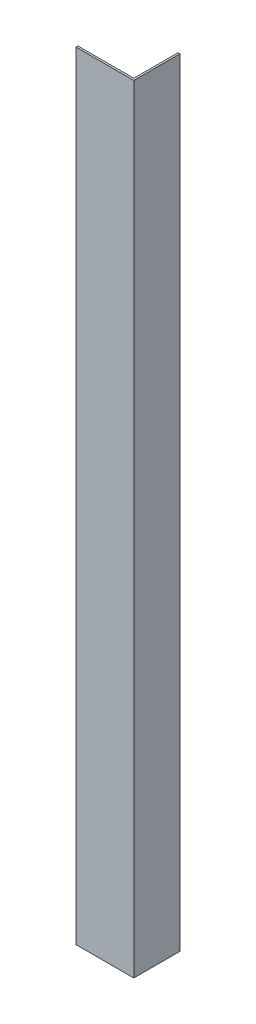
ISO-10303-21;
HEADER;
FILE_DESCRIPTION(('STEP AP214'),'2;1');
FILE_NAME('part.step','',(''),(''),'','','');
FILE_SCHEMA(('AUTOMOTIVE_DESIGN { 1 0 10303 214 1 1 1 1 }'));
ENDSEC;
DATA;
#1=APPLICATION_CONTEXT('core data for automotive mechanical design processes');
#2=APPLICATION_PROTOCOL_DEFINITION('international standard','automotive_design',2000,#1);
#3=PRODUCT_CONTEXT('',#1,'mechanical');
#4=PRODUCT('Part','Part','',(#3));
#5=PRODUCT_RELATED_PRODUCT_CATEGORY('part','',(#4));
#6=PRODUCT_DEFINITION_FORMATION('','',#4);
#7=PRODUCT_DEFINITION_CONTEXT('part definition',#1,'design');
#8=PRODUCT_DEFINITION('design','',#6,#7);
#9=PRODUCT_DEFINITION_SHAPE('','',#8);
#10=(LENGTH_UNIT() NAMED_UNIT(*) SI_UNIT(.MILLI.,.METRE.));
#11=(NAMED_UNIT(*) PLANE_ANGLE_UNIT() SI_UNIT($,.RADIAN.));
#12=(NAMED_UNIT(*) SI_UNIT($,.STERADIAN.) SOLID_ANGLE_UNIT());
#13=UNCERTAINTY_MEASURE_WITH_UNIT(LENGTH_MEASURE(1.E-05),#10,'distance_accuracy_value','');
#14=(GEOMETRIC_REPRESENTATION_CONTEXT(3) GLOBAL_UNCERTAINTY_ASSIGNED_CONTEXT((#13)) GLOBAL_UNIT_ASSIGNED_CONTEXT((#10,
#11,#12)) REPRESENTATION_CONTEXT('',''));
#15=CARTESIAN_POINT('',(0.,0.,0.));
#16=DIRECTION('',(0.,0.,1.));
#17=DIRECTION('',(1.,0.,0.));
#18=AXIS2_PLACEMENT_3D('',#15,#16,#17);
#19=CARTESIAN_POINT('',(0.,202.,-0.5));
#20=DIRECTION('',(1.,0.,0.));
#21=DIRECTION('',(0.,0.,-1.));
#22=AXIS2_PLACEMENT_3D('',#19,#20,#21);
#23=PLANE('',#22);
#24=DIRECTION('',(0.,0.,1.));
#25=VECTOR('',#24,1.);
#26=CARTESIAN_POINT('',(0.,0.,-0.5));
#27=LINE('',#26,#25);
#28=CARTESIAN_POINT('',(0.,0.,-0.5));
#29=VERTEX_POINT('',#28);
#30=CARTESIAN_POINT('',(0.,0.,0.));
#31=VERTEX_POINT('',#30);
#32=EDGE_CURVE('E125',#29,#31,#27,.T.);
#33=ORIENTED_EDGE('',*,*,#32,.T.);
#34=DIRECTION('',(0.,-1.,0.));
#35=VECTOR('',#34,1.);
#36=CARTESIAN_POINT('',(0.,202.,0.));
#37=LINE('',#36,#35);
#38=CARTESIAN_POINT('',(0.,202.,0.));
#39=VERTEX_POINT('',#38);
#40=EDGE_CURVE('E11',#39,#31,#37,.T.);
#41=ORIENTED_EDGE('',*,*,#40,.F.);
#42=DIRECTION('',(0.,0.,1.));
#43=VECTOR('',#42,1.);
#44=CARTESIAN_POINT('',(0.,202.,-0.5));
#45=LINE('',#44,#43);
#46=CARTESIAN_POINT('',(0.,202.,-0.5));
#47=VERTEX_POINT('',#46);
#48=EDGE_CURVE('E135',#47,#39,#45,.T.);
#49=ORIENTED_EDGE('',*,*,#48,.F.);
#50=DIRECTION('',(0.,-1.,0.));
#51=VECTOR('',#50,1.);
#52=CARTESIAN_POINT('',(0.,202.,-0.5));
#53=LINE('',#52,#51);
#54=EDGE_CURVE('E121',#47,#29,#53,.T.);
#55=ORIENTED_EDGE('',*,*,#54,.T.);
#56=EDGE_LOOP('',(#33,#41,#49,#55));
#57=FACE_BOUND('',#56,.T.);
#58=ADVANCED_FACE('F41',(#57),#23,.F.);
#59=CARTESIAN_POINT('',(0.,202.,0.));
#60=DIRECTION('',(0.,0.,-1.));
#61=DIRECTION('',(-1.,0.,0.));
#62=AXIS2_PLACEMENT_3D('',#59,#60,#61);
#63=PLANE('',#62);
#64=DIRECTION('',(1.,0.,0.));
#65=VECTOR('',#64,1.);
#66=CARTESIAN_POINT('',(0.,0.,0.));
#67=LINE('',#66,#65);
#68=CARTESIAN_POINT('',(15.,0.,0.));
#69=VERTEX_POINT('',#68);
#70=EDGE_CURVE('E128',#31,#69,#67,.T.);
#71=ORIENTED_EDGE('',*,*,#70,.T.);
#72=DIRECTION('',(0.,-1.,0.));
#73=VECTOR('',#72,1.);
#74=CARTESIAN_POINT('',(15.,202.,0.));
#75=LINE('',#74,#73);
#76=CARTESIAN_POINT('',(15.,202.,0.));
#77=VERTEX_POINT('',#76);
#78=EDGE_CURVE('E49',#77,#69,#75,.T.);
#79=ORIENTED_EDGE('',*,*,#78,.F.);
#80=DIRECTION('',(1.,0.,0.));
#81=VECTOR('',#80,1.);
#82=CARTESIAN_POINT('',(0.,202.,0.));
#83=LINE('',#82,#81);
#84=EDGE_CURVE('E94',#39,#77,#83,.T.);
#85=ORIENTED_EDGE('',*,*,#84,.F.);
#86=ORIENTED_EDGE('',*,*,#40,.T.);
#87=EDGE_LOOP('',(#71,#79,#85,#86));
#88=FACE_BOUND('',#87,.T.);
#89=ADVANCED_FACE('F159',(#88),#63,.F.);
#90=CARTESIAN_POINT('',(15.,202.,0.));
#91=DIRECTION('',(-1.,0.,0.));
#92=DIRECTION('',(0.,0.,1.));
#93=AXIS2_PLACEMENT_3D('',#90,#91,#92);
#94=PLANE('',#93);
#95=DIRECTION('',(0.,0.,-1.));
#96=VECTOR('',#95,1.);
#97=CARTESIAN_POINT('',(15.,0.,0.));
#98=LINE('',#97,#96);
#99=CARTESIAN_POINT('',(15.,0.,-12.));
#100=VERTEX_POINT('',#99);
#101=EDGE_CURVE('E130',#69,#100,#98,.T.);
#102=ORIENTED_EDGE('',*,*,#101,.T.);
#103=DIRECTION('',(0.,-1.,0.));
#104=VECTOR('',#103,1.);
#105=CARTESIAN_POINT('',(15.,202.,-12.));
#106=LINE('',#105,#104);
#107=CARTESIAN_POINT('',(15.,202.,-12.));
#108=VERTEX_POINT('',#107);
#109=EDGE_CURVE('E116',#108,#100,#106,.T.);
#110=ORIENTED_EDGE('',*,*,#109,.F.);
#111=DIRECTION('',(0.,0.,-1.));
#112=VECTOR('',#111,1.);
#113=CARTESIAN_POINT('',(15.,202.,0.));
#114=LINE('',#113,#112);
#115=EDGE_CURVE('E107',#77,#108,#114,.T.);
#116=ORIENTED_EDGE('',*,*,#115,.F.);
#117=ORIENTED_EDGE('',*,*,#78,.T.);
#118=EDGE_LOOP('',(#102,#110,#116,#117));
#119=FACE_BOUND('',#118,.T.);
#120=ADVANCED_FACE('F141',(#119),#94,.F.);
#121=CARTESIAN_POINT('',(15.,202.,-12.));
#122=DIRECTION('',(0.,0.,1.));
#123=DIRECTION('',(1.,0.,0.));
#124=AXIS2_PLACEMENT_3D('',#121,#122,#123);
#125=PLANE('',#124);
#126=DIRECTION('',(-1.,0.,0.));
#127=VECTOR('',#126,1.);
#128=CARTESIAN_POINT('',(15.,0.,-12.));
#129=LINE('',#128,#127);
#130=CARTESIAN_POINT('',(14.5,0.,-12.));
#131=VERTEX_POINT('',#130);
#132=EDGE_CURVE('E115',#100,#131,#129,.T.);
#133=ORIENTED_EDGE('',*,*,#132,.T.);
#134=DIRECTION('',(0.,-1.,0.));
#135=VECTOR('',#134,1.);
#136=CARTESIAN_POINT('',(14.5,202.,-12.));
#137=LINE('',#136,#135);
#138=CARTESIAN_POINT('',(14.5,202.,-12.));
#139=VERTEX_POINT('',#138);
#140=EDGE_CURVE('E112',#139,#131,#137,.T.);
#141=ORIENTED_EDGE('',*,*,#140,.F.);
#142=DIRECTION('',(-1.,0.,0.));
#143=VECTOR('',#142,1.);
#144=CARTESIAN_POINT('',(15.,202.,-12.));
#145=LINE('',#144,#143);
#146=EDGE_CURVE('E101',#108,#139,#145,.T.);
#147=ORIENTED_EDGE('',*,*,#146,.F.);
#148=ORIENTED_EDGE('',*,*,#109,.T.);
#149=EDGE_LOOP('',(#133,#141,#147,#148));
#150=FACE_BOUND('',#149,.T.);
#151=ADVANCED_FACE('F113',(#150),#125,.F.);
#152=CARTESIAN_POINT('',(14.5,202.,-12.));
#153=DIRECTION('',(1.,0.,0.));
#154=DIRECTION('',(0.,0.,-1.));
#155=AXIS2_PLACEMENT_3D('',#152,#153,#154);
#156=PLANE('',#155);
#157=DIRECTION('',(0.,0.,1.));
#158=VECTOR('',#157,1.);
#159=CARTESIAN_POINT('',(14.5,0.,-12.));
#160=LINE('',#159,#158);
#161=CARTESIAN_POINT('',(14.5,0.,-0.500000000000002));
#162=VERTEX_POINT('',#161);
#163=EDGE_CURVE('E80',#131,#162,#160,.T.);
#164=ORIENTED_EDGE('',*,*,#163,.T.);
#165=DIRECTION('',(0.,-1.,0.));
#166=VECTOR('',#165,1.);
#167=CARTESIAN_POINT('',(14.5,202.,-0.500000000000002));
#168=LINE('',#167,#166);
#169=CARTESIAN_POINT('',(14.5,202.,-0.500000000000002));
#170=VERTEX_POINT('',#169);
#171=EDGE_CURVE('E117',#170,#162,#168,.T.);
#172=ORIENTED_EDGE('',*,*,#171,.F.);
#173=DIRECTION('',(0.,0.,1.));
#174=VECTOR('',#173,1.);
#175=CARTESIAN_POINT('',(14.5,202.,-12.));
#176=LINE('',#175,#174);
#177=EDGE_CURVE('E105',#139,#170,#176,.T.);
#178=ORIENTED_EDGE('',*,*,#177,.F.);
#179=ORIENTED_EDGE('',*,*,#140,.T.);
#180=EDGE_LOOP('',(#164,#172,#178,#179));
#181=FACE_BOUND('',#180,.T.);
#182=ADVANCED_FACE('F119',(#181),#156,.F.);
#183=CARTESIAN_POINT('',(14.5,202.,-0.500000000000002));
#184=DIRECTION('',(0.,0.,1.));
#185=DIRECTION('',(1.,0.,0.));
#186=AXIS2_PLACEMENT_3D('',#183,#184,#185);
#187=PLANE('',#186);
#188=DIRECTION('',(-1.,0.,0.));
#189=VECTOR('',#188,1.);
#190=CARTESIAN_POINT('',(14.5,0.,-0.500000000000002));
#191=LINE('',#190,#189);
#192=EDGE_CURVE('E86',#162,#29,#191,.T.);
#193=ORIENTED_EDGE('',*,*,#192,.T.);
#194=ORIENTED_EDGE('',*,*,#54,.F.);
#195=DIRECTION('',(-1.,0.,0.));
#196=VECTOR('',#195,1.);
#197=CARTESIAN_POINT('',(14.5,202.,-0.500000000000002));
#198=LINE('',#197,#196);
#199=EDGE_CURVE('E57',#170,#47,#198,.T.);
#200=ORIENTED_EDGE('',*,*,#199,.F.);
#201=ORIENTED_EDGE('',*,*,#171,.T.);
#202=EDGE_LOOP('',(#193,#194,#200,#201));
#203=FACE_BOUND('',#202,.T.);
#204=ADVANCED_FACE('F148',(#203),#187,.F.);
#205=CARTESIAN_POINT('',(0.,202.,0.));
#206=DIRECTION('',(0.,1.,0.));
#207=DIRECTION('',(0.,0.,1.));
#208=AXIS2_PLACEMENT_3D('',#205,#206,#207);
#209=PLANE('',#208);
#210=ORIENTED_EDGE('',*,*,#48,.T.);
#211=ORIENTED_EDGE('',*,*,#84,.T.);
#212=ORIENTED_EDGE('',*,*,#115,.T.);
#213=ORIENTED_EDGE('',*,*,#146,.T.);
#214=ORIENTED_EDGE('',*,*,#177,.T.);
#215=ORIENTED_EDGE('',*,*,#199,.T.);
#216=EDGE_LOOP('',(#210,#211,#212,#213,#214,#215));
#217=FACE_BOUND('',#216,.T.);
#218=ADVANCED_FACE('F103',(#217),#209,.T.);
#219=CARTESIAN_POINT('',(0.,0.,0.));
#220=DIRECTION('',(0.,1.,0.));
#221=DIRECTION('',(0.,0.,1.));
#222=AXIS2_PLACEMENT_3D('',#219,#220,#221);
#223=PLANE('',#222);
#224=ORIENTED_EDGE('',*,*,#32,.F.);
#225=ORIENTED_EDGE('',*,*,#192,.F.);
#226=ORIENTED_EDGE('',*,*,#163,.F.);
#227=ORIENTED_EDGE('',*,*,#132,.F.);
#228=ORIENTED_EDGE('',*,*,#101,.F.);
#229=ORIENTED_EDGE('',*,*,#70,.F.);
#230=EDGE_LOOP('',(#224,#225,#226,#227,#228,#229));
#231=FACE_BOUND('',#230,.T.);
#232=ADVANCED_FACE('F144',(#231),#223,.F.);
#233=CLOSED_SHELL('',(#58,#89,#120,#151,#182,#204,#218,#232));
#234=MANIFOLD_SOLID_BREP('B2',#233);
#235=ADVANCED_BREP_SHAPE_REPRESENTATION('',(#18,#234),#14);
#236=SHAPE_DEFINITION_REPRESENTATION(#9,#235);
ENDSEC;
END-ISO-10303-21;
